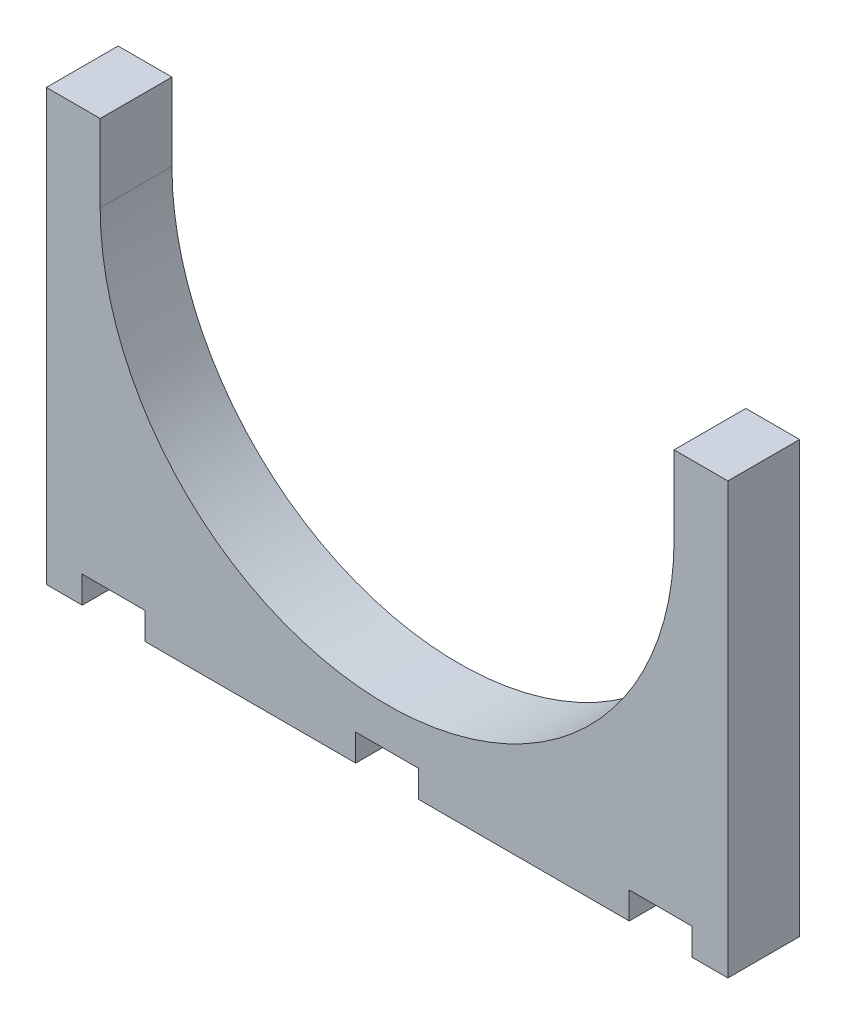
ISO-10303-21;
HEADER;
FILE_DESCRIPTION(('STEP AP214'),'2;1');
FILE_NAME('part.step','',(''),(''),'','','');
FILE_SCHEMA(('AUTOMOTIVE_DESIGN { 1 0 10303 214 1 1 1 1 }'));
ENDSEC;
DATA;
#1=APPLICATION_CONTEXT('core data for automotive mechanical design processes');
#2=APPLICATION_PROTOCOL_DEFINITION('international standard','automotive_design',2000,#1);
#3=PRODUCT_CONTEXT('',#1,'mechanical');
#4=PRODUCT('Part','Part','',(#3));
#5=PRODUCT_RELATED_PRODUCT_CATEGORY('part','',(#4));
#6=PRODUCT_DEFINITION_FORMATION('','',#4);
#7=PRODUCT_DEFINITION_CONTEXT('part definition',#1,'design');
#8=PRODUCT_DEFINITION('design','',#6,#7);
#9=PRODUCT_DEFINITION_SHAPE('','',#8);
#10=(LENGTH_UNIT() NAMED_UNIT(*) SI_UNIT(.MILLI.,.METRE.));
#11=(NAMED_UNIT(*) PLANE_ANGLE_UNIT() SI_UNIT($,.RADIAN.));
#12=(NAMED_UNIT(*) SI_UNIT($,.STERADIAN.) SOLID_ANGLE_UNIT());
#13=UNCERTAINTY_MEASURE_WITH_UNIT(LENGTH_MEASURE(1.E-05),#10,'distance_accuracy_value','');
#14=(GEOMETRIC_REPRESENTATION_CONTEXT(3) GLOBAL_UNCERTAINTY_ASSIGNED_CONTEXT((#13)) GLOBAL_UNIT_ASSIGNED_CONTEXT((#10,
#11,#12)) REPRESENTATION_CONTEXT('',''));
#15=CARTESIAN_POINT('',(0.,0.,0.));
#16=DIRECTION('',(0.,0.,1.));
#17=DIRECTION('',(1.,0.,0.));
#18=AXIS2_PLACEMENT_3D('',#15,#16,#17);
#19=CARTESIAN_POINT('',(0.,0.,101.6));
#20=DIRECTION('',(1.,0.,0.));
#21=DIRECTION('',(0.,0.,-1.));
#22=AXIS2_PLACEMENT_3D('',#19,#20,#21);
#23=PLANE('',#22);
#24=DIRECTION('',(0.,-1.,0.));
#25=VECTOR('',#24,1.);
#26=CARTESIAN_POINT('',(0.,0.,0.));
#27=LINE('',#26,#25);
#28=CARTESIAN_POINT('',(0.,609.6,0.));
#29=VERTEX_POINT('',#28);
#30=CARTESIAN_POINT('',(0.,0.,0.));
#31=VERTEX_POINT('',#30);
#32=EDGE_CURVE('E203',#29,#31,#27,.T.);
#33=ORIENTED_EDGE('',*,*,#32,.T.);
#34=DIRECTION('',(0.,0.,-1.));
#35=VECTOR('',#34,1.);
#36=CARTESIAN_POINT('',(0.,0.,101.6));
#37=LINE('',#36,#35);
#38=CARTESIAN_POINT('',(0.,0.,101.6));
#39=VERTEX_POINT('',#38);
#40=EDGE_CURVE('E11',#39,#31,#37,.T.);
#41=ORIENTED_EDGE('',*,*,#40,.F.);
#42=DIRECTION('',(0.,-1.,0.));
#43=VECTOR('',#42,1.);
#44=CARTESIAN_POINT('',(0.,0.,101.6));
#45=LINE('',#44,#43);
#46=CARTESIAN_POINT('',(0.,609.6,101.6));
#47=VERTEX_POINT('',#46);
#48=EDGE_CURVE('E241',#47,#39,#45,.T.);
#49=ORIENTED_EDGE('',*,*,#48,.F.);
#50=DIRECTION('',(0.,0.,-1.));
#51=VECTOR('',#50,1.);
#52=CARTESIAN_POINT('',(0.,609.6,101.6));
#53=LINE('',#52,#51);
#54=EDGE_CURVE('E199',#47,#29,#53,.T.);
#55=ORIENTED_EDGE('',*,*,#54,.T.);
#56=EDGE_LOOP('',(#33,#41,#49,#55));
#57=FACE_BOUND('',#56,.T.);
#58=ADVANCED_FACE('F35',(#57),#23,.F.);
#59=CARTESIAN_POINT('',(0.,0.,101.6));
#60=DIRECTION('',(0.,1.,0.));
#61=DIRECTION('',(0.,0.,1.));
#62=AXIS2_PLACEMENT_3D('',#59,#60,#61);
#63=PLANE('',#62);
#64=DIRECTION('',(1.,0.,0.));
#65=VECTOR('',#64,1.);
#66=CARTESIAN_POINT('',(0.,0.,0.));
#67=LINE('',#66,#65);
#68=CARTESIAN_POINT('',(50.8,0.,0.));
#69=VERTEX_POINT('',#68);
#70=EDGE_CURVE('E206',#31,#69,#67,.T.);
#71=ORIENTED_EDGE('',*,*,#70,.T.);
#72=DIRECTION('',(0.,0.,-1.));
#73=VECTOR('',#72,1.);
#74=CARTESIAN_POINT('',(50.8,0.,101.6));
#75=LINE('',#74,#73);
#76=CARTESIAN_POINT('',(50.8,0.,101.6));
#77=VERTEX_POINT('',#76);
#78=EDGE_CURVE('E43',#77,#69,#75,.T.);
#79=ORIENTED_EDGE('',*,*,#78,.F.);
#80=DIRECTION('',(1.,0.,0.));
#81=VECTOR('',#80,1.);
#82=CARTESIAN_POINT('',(0.,0.,101.6));
#83=LINE('',#82,#81);
#84=EDGE_CURVE('E130',#39,#77,#83,.T.);
#85=ORIENTED_EDGE('',*,*,#84,.F.);
#86=ORIENTED_EDGE('',*,*,#40,.T.);
#87=EDGE_LOOP('',(#71,#79,#85,#86));
#88=FACE_BOUND('',#87,.T.);
#89=ADVANCED_FACE('F359',(#88),#63,.F.);
#90=CARTESIAN_POINT('',(50.8,0.,101.6));
#91=DIRECTION('',(-1.,0.,0.));
#92=DIRECTION('',(0.,0.,1.));
#93=AXIS2_PLACEMENT_3D('',#90,#91,#92);
#94=PLANE('',#93);
#95=DIRECTION('',(0.,1.,0.));
#96=VECTOR('',#95,1.);
#97=CARTESIAN_POINT('',(50.8,0.,0.));
#98=LINE('',#97,#96);
#99=CARTESIAN_POINT('',(50.8,38.1,0.));
#100=VERTEX_POINT('',#99);
#101=EDGE_CURVE('E208',#69,#100,#98,.T.);
#102=ORIENTED_EDGE('',*,*,#101,.T.);
#103=DIRECTION('',(0.,0.,-1.));
#104=VECTOR('',#103,1.);
#105=CARTESIAN_POINT('',(50.8,38.1,101.6));
#106=LINE('',#105,#104);
#107=CARTESIAN_POINT('',(50.8,38.1,101.6));
#108=VERTEX_POINT('',#107);
#109=EDGE_CURVE('E284',#108,#100,#106,.T.);
#110=ORIENTED_EDGE('',*,*,#109,.F.);
#111=DIRECTION('',(0.,1.,0.));
#112=VECTOR('',#111,1.);
#113=CARTESIAN_POINT('',(50.8,0.,101.6));
#114=LINE('',#113,#112);
#115=EDGE_CURVE('E292',#77,#108,#114,.T.);
#116=ORIENTED_EDGE('',*,*,#115,.F.);
#117=ORIENTED_EDGE('',*,*,#78,.T.);
#118=EDGE_LOOP('',(#102,#110,#116,#117));
#119=FACE_BOUND('',#118,.T.);
#120=ADVANCED_FACE('F290',(#119),#94,.F.);
#121=CARTESIAN_POINT('',(50.8,38.1,101.6));
#122=DIRECTION('',(0.,1.,0.));
#123=DIRECTION('',(0.,0.,1.));
#124=AXIS2_PLACEMENT_3D('',#121,#122,#123);
#125=PLANE('',#124);
#126=DIRECTION('',(1.,0.,0.));
#127=VECTOR('',#126,1.);
#128=CARTESIAN_POINT('',(50.8,38.1,0.));
#129=LINE('',#128,#127);
#130=CARTESIAN_POINT('',(139.7,38.1,0.));
#131=VERTEX_POINT('',#130);
#132=EDGE_CURVE('E210',#100,#131,#129,.T.);
#133=ORIENTED_EDGE('',*,*,#132,.T.);
#134=DIRECTION('',(0.,0.,-1.));
#135=VECTOR('',#134,1.);
#136=CARTESIAN_POINT('',(139.7,38.1,101.6));
#137=LINE('',#136,#135);
#138=CARTESIAN_POINT('',(139.7,38.1,101.6));
#139=VERTEX_POINT('',#138);
#140=EDGE_CURVE('E281',#139,#131,#137,.T.);
#141=ORIENTED_EDGE('',*,*,#140,.F.);
#142=DIRECTION('',(1.,0.,0.));
#143=VECTOR('',#142,1.);
#144=CARTESIAN_POINT('',(50.8,38.1,101.6));
#145=LINE('',#144,#143);
#146=EDGE_CURVE('E310',#108,#139,#145,.T.);
#147=ORIENTED_EDGE('',*,*,#146,.F.);
#148=ORIENTED_EDGE('',*,*,#109,.T.);
#149=EDGE_LOOP('',(#133,#141,#147,#148));
#150=FACE_BOUND('',#149,.T.);
#151=ADVANCED_FACE('F301',(#150),#125,.F.);
#152=CARTESIAN_POINT('',(139.7,38.1,101.6));
#153=DIRECTION('',(1.,0.,0.));
#154=DIRECTION('',(0.,0.,-1.));
#155=AXIS2_PLACEMENT_3D('',#152,#153,#154);
#156=PLANE('',#155);
#157=DIRECTION('',(0.,-1.,0.));
#158=VECTOR('',#157,1.);
#159=CARTESIAN_POINT('',(139.7,38.1,0.));
#160=LINE('',#159,#158);
#161=CARTESIAN_POINT('',(139.7,0.,0.));
#162=VERTEX_POINT('',#161);
#163=EDGE_CURVE('E212',#131,#162,#160,.T.);
#164=ORIENTED_EDGE('',*,*,#163,.T.);
#165=DIRECTION('',(0.,0.,-1.));
#166=VECTOR('',#165,1.);
#167=CARTESIAN_POINT('',(139.7,0.,101.6));
#168=LINE('',#167,#166);
#169=CARTESIAN_POINT('',(139.7,0.,101.6));
#170=VERTEX_POINT('',#169);
#171=EDGE_CURVE('E278',#170,#162,#168,.T.);
#172=ORIENTED_EDGE('',*,*,#171,.F.);
#173=DIRECTION('',(0.,-1.,0.));
#174=VECTOR('',#173,1.);
#175=CARTESIAN_POINT('',(139.7,38.1,101.6));
#176=LINE('',#175,#174);
#177=EDGE_CURVE('E307',#139,#170,#176,.T.);
#178=ORIENTED_EDGE('',*,*,#177,.F.);
#179=ORIENTED_EDGE('',*,*,#140,.T.);
#180=EDGE_LOOP('',(#164,#172,#178,#179));
#181=FACE_BOUND('',#180,.T.);
#182=ADVANCED_FACE('F305',(#181),#156,.F.);
#183=CARTESIAN_POINT('',(139.7,0.,101.6));
#184=DIRECTION('',(0.,1.,0.));
#185=DIRECTION('',(0.,0.,1.));
#186=AXIS2_PLACEMENT_3D('',#183,#184,#185);
#187=PLANE('',#186);
#188=DIRECTION('',(1.,0.,0.));
#189=VECTOR('',#188,1.);
#190=CARTESIAN_POINT('',(139.7,0.,0.));
#191=LINE('',#190,#189);
#192=CARTESIAN_POINT('',(438.1,0.,0.));
#193=VERTEX_POINT('',#192);
#194=EDGE_CURVE('E214',#162,#193,#191,.T.);
#195=ORIENTED_EDGE('',*,*,#194,.T.);
#196=DIRECTION('',(0.,0.,-1.));
#197=VECTOR('',#196,1.);
#198=CARTESIAN_POINT('',(438.1,0.,101.6));
#199=LINE('',#198,#197);
#200=CARTESIAN_POINT('',(438.1,0.,101.6));
#201=VERTEX_POINT('',#200);
#202=EDGE_CURVE('E275',#201,#193,#199,.T.);
#203=ORIENTED_EDGE('',*,*,#202,.F.);
#204=DIRECTION('',(1.,0.,0.));
#205=VECTOR('',#204,1.);
#206=CARTESIAN_POINT('',(139.7,0.,101.6));
#207=LINE('',#206,#205);
#208=EDGE_CURVE('E309',#170,#201,#207,.T.);
#209=ORIENTED_EDGE('',*,*,#208,.F.);
#210=ORIENTED_EDGE('',*,*,#171,.T.);
#211=EDGE_LOOP('',(#195,#203,#209,#210));
#212=FACE_BOUND('',#211,.T.);
#213=ADVANCED_FACE('F372',(#212),#187,.F.);
#214=CARTESIAN_POINT('',(438.1,0.,101.6));
#215=DIRECTION('',(-1.,0.,0.));
#216=DIRECTION('',(0.,0.,1.));
#217=AXIS2_PLACEMENT_3D('',#214,#215,#216);
#218=PLANE('',#217);
#219=DIRECTION('',(0.,1.,0.));
#220=VECTOR('',#219,1.);
#221=CARTESIAN_POINT('',(438.1,0.,0.));
#222=LINE('',#221,#220);
#223=CARTESIAN_POINT('',(438.1,38.1,0.));
#224=VERTEX_POINT('',#223);
#225=EDGE_CURVE('E216',#193,#224,#222,.T.);
#226=ORIENTED_EDGE('',*,*,#225,.T.);
#227=DIRECTION('',(0.,0.,-1.));
#228=VECTOR('',#227,1.);
#229=CARTESIAN_POINT('',(438.1,38.1,101.6));
#230=LINE('',#229,#228);
#231=CARTESIAN_POINT('',(438.1,38.1,101.6));
#232=VERTEX_POINT('',#231);
#233=EDGE_CURVE('E272',#232,#224,#230,.T.);
#234=ORIENTED_EDGE('',*,*,#233,.F.);
#235=DIRECTION('',(0.,1.,0.));
#236=VECTOR('',#235,1.);
#237=CARTESIAN_POINT('',(438.1,0.,101.6));
#238=LINE('',#237,#236);
#239=EDGE_CURVE('E312',#201,#232,#238,.T.);
#240=ORIENTED_EDGE('',*,*,#239,.F.);
#241=ORIENTED_EDGE('',*,*,#202,.T.);
#242=EDGE_LOOP('',(#226,#234,#240,#241));
#243=FACE_BOUND('',#242,.T.);
#244=ADVANCED_FACE('F375',(#243),#218,.F.);
#245=CARTESIAN_POINT('',(438.1,38.1,101.6));
#246=DIRECTION('',(0.,1.,0.));
#247=DIRECTION('',(0.,0.,1.));
#248=AXIS2_PLACEMENT_3D('',#245,#246,#247);
#249=PLANE('',#248);
#250=DIRECTION('',(1.,0.,0.));
#251=VECTOR('',#250,1.);
#252=CARTESIAN_POINT('',(438.1,38.1,0.));
#253=LINE('',#252,#251);
#254=CARTESIAN_POINT('',(527.,38.1,0.));
#255=VERTEX_POINT('',#254);
#256=EDGE_CURVE('E218',#224,#255,#253,.T.);
#257=ORIENTED_EDGE('',*,*,#256,.T.);
#258=DIRECTION('',(0.,0.,-1.));
#259=VECTOR('',#258,1.);
#260=CARTESIAN_POINT('',(527.,38.1,101.6));
#261=LINE('',#260,#259);
#262=CARTESIAN_POINT('',(527.,38.1,101.6));
#263=VERTEX_POINT('',#262);
#264=EDGE_CURVE('E269',#263,#255,#261,.T.);
#265=ORIENTED_EDGE('',*,*,#264,.F.);
#266=DIRECTION('',(1.,0.,0.));
#267=VECTOR('',#266,1.);
#268=CARTESIAN_POINT('',(438.1,38.1,101.6));
#269=LINE('',#268,#267);
#270=EDGE_CURVE('E318',#232,#263,#269,.T.);
#271=ORIENTED_EDGE('',*,*,#270,.F.);
#272=ORIENTED_EDGE('',*,*,#233,.T.);
#273=EDGE_LOOP('',(#257,#265,#271,#272));
#274=FACE_BOUND('',#273,.T.);
#275=ADVANCED_FACE('F379',(#274),#249,.F.);
#276=CARTESIAN_POINT('',(527.,38.1,101.6));
#277=DIRECTION('',(1.,0.,0.));
#278=DIRECTION('',(0.,0.,-1.));
#279=AXIS2_PLACEMENT_3D('',#276,#277,#278);
#280=PLANE('',#279);
#281=DIRECTION('',(0.,-1.,0.));
#282=VECTOR('',#281,1.);
#283=CARTESIAN_POINT('',(527.,38.1,0.));
#284=LINE('',#283,#282);
#285=CARTESIAN_POINT('',(527.,0.,0.));
#286=VERTEX_POINT('',#285);
#287=EDGE_CURVE('E220',#255,#286,#284,.T.);
#288=ORIENTED_EDGE('',*,*,#287,.T.);
#289=DIRECTION('',(0.,0.,-1.));
#290=VECTOR('',#289,1.);
#291=CARTESIAN_POINT('',(527.,0.,101.6));
#292=LINE('',#291,#290);
#293=CARTESIAN_POINT('',(527.,0.,101.6));
#294=VERTEX_POINT('',#293);
#295=EDGE_CURVE('E266',#294,#286,#292,.T.);
#296=ORIENTED_EDGE('',*,*,#295,.F.);
#297=DIRECTION('',(0.,-1.,0.));
#298=VECTOR('',#297,1.);
#299=CARTESIAN_POINT('',(527.,38.1,101.6));
#300=LINE('',#299,#298);
#301=EDGE_CURVE('E320',#263,#294,#300,.T.);
#302=ORIENTED_EDGE('',*,*,#301,.F.);
#303=ORIENTED_EDGE('',*,*,#264,.T.);
#304=EDGE_LOOP('',(#288,#296,#302,#303));
#305=FACE_BOUND('',#304,.T.);
#306=ADVANCED_FACE('F383',(#305),#280,.F.);
#307=CARTESIAN_POINT('',(527.,0.,101.6));
#308=DIRECTION('',(0.,1.,0.));
#309=DIRECTION('',(0.,0.,1.));
#310=AXIS2_PLACEMENT_3D('',#307,#308,#309);
#311=PLANE('',#310);
#312=DIRECTION('',(1.,0.,0.));
#313=VECTOR('',#312,1.);
#314=CARTESIAN_POINT('',(527.,0.,0.));
#315=LINE('',#314,#313);
#316=CARTESIAN_POINT('',(825.4,0.,0.));
#317=VERTEX_POINT('',#316);
#318=EDGE_CURVE('E222',#286,#317,#315,.T.);
#319=ORIENTED_EDGE('',*,*,#318,.T.);
#320=DIRECTION('',(0.,0.,-1.));
#321=VECTOR('',#320,1.);
#322=CARTESIAN_POINT('',(825.4,0.,101.6));
#323=LINE('',#322,#321);
#324=CARTESIAN_POINT('',(825.4,0.,101.6));
#325=VERTEX_POINT('',#324);
#326=EDGE_CURVE('E263',#325,#317,#323,.T.);
#327=ORIENTED_EDGE('',*,*,#326,.F.);
#328=DIRECTION('',(1.,0.,0.));
#329=VECTOR('',#328,1.);
#330=CARTESIAN_POINT('',(527.,0.,101.6));
#331=LINE('',#330,#329);
#332=EDGE_CURVE('E322',#294,#325,#331,.T.);
#333=ORIENTED_EDGE('',*,*,#332,.F.);
#334=ORIENTED_EDGE('',*,*,#295,.T.);
#335=EDGE_LOOP('',(#319,#327,#333,#334));
#336=FACE_BOUND('',#335,.T.);
#337=ADVANCED_FACE('F387',(#336),#311,.F.);
#338=CARTESIAN_POINT('',(825.4,0.,101.6));
#339=DIRECTION('',(-1.,0.,0.));
#340=DIRECTION('',(0.,0.,1.));
#341=AXIS2_PLACEMENT_3D('',#338,#339,#340);
#342=PLANE('',#341);
#343=DIRECTION('',(0.,1.,0.));
#344=VECTOR('',#343,1.);
#345=CARTESIAN_POINT('',(825.4,0.,0.));
#346=LINE('',#345,#344);
#347=CARTESIAN_POINT('',(825.4,38.1,0.));
#348=VERTEX_POINT('',#347);
#349=EDGE_CURVE('E224',#317,#348,#346,.T.);
#350=ORIENTED_EDGE('',*,*,#349,.T.);
#351=DIRECTION('',(0.,0.,-1.));
#352=VECTOR('',#351,1.);
#353=CARTESIAN_POINT('',(825.4,38.1,101.6));
#354=LINE('',#353,#352);
#355=CARTESIAN_POINT('',(825.4,38.1,101.6));
#356=VERTEX_POINT('',#355);
#357=EDGE_CURVE('E260',#356,#348,#354,.T.);
#358=ORIENTED_EDGE('',*,*,#357,.F.);
#359=DIRECTION('',(0.,1.,0.));
#360=VECTOR('',#359,1.);
#361=CARTESIAN_POINT('',(825.4,0.,101.6));
#362=LINE('',#361,#360);
#363=EDGE_CURVE('E324',#325,#356,#362,.T.);
#364=ORIENTED_EDGE('',*,*,#363,.F.);
#365=ORIENTED_EDGE('',*,*,#326,.T.);
#366=EDGE_LOOP('',(#350,#358,#364,#365));
#367=FACE_BOUND('',#366,.T.);
#368=ADVANCED_FACE('F391',(#367),#342,.F.);
#369=CARTESIAN_POINT('',(825.4,38.1,101.6));
#370=DIRECTION('',(0.,1.,0.));
#371=DIRECTION('',(0.,0.,1.));
#372=AXIS2_PLACEMENT_3D('',#369,#370,#371);
#373=PLANE('',#372);
#374=DIRECTION('',(1.,0.,0.));
#375=VECTOR('',#374,1.);
#376=CARTESIAN_POINT('',(825.4,38.1,0.));
#377=LINE('',#376,#375);
#378=CARTESIAN_POINT('',(914.3,38.1,0.));
#379=VERTEX_POINT('',#378);
#380=EDGE_CURVE('E226',#348,#379,#377,.T.);
#381=ORIENTED_EDGE('',*,*,#380,.T.);
#382=DIRECTION('',(0.,0.,-1.));
#383=VECTOR('',#382,1.);
#384=CARTESIAN_POINT('',(914.3,38.1,101.6));
#385=LINE('',#384,#383);
#386=CARTESIAN_POINT('',(914.3,38.1,101.6));
#387=VERTEX_POINT('',#386);
#388=EDGE_CURVE('E257',#387,#379,#385,.T.);
#389=ORIENTED_EDGE('',*,*,#388,.F.);
#390=DIRECTION('',(1.,0.,0.));
#391=VECTOR('',#390,1.);
#392=CARTESIAN_POINT('',(825.4,38.1,101.6));
#393=LINE('',#392,#391);
#394=EDGE_CURVE('E326',#356,#387,#393,.T.);
#395=ORIENTED_EDGE('',*,*,#394,.F.);
#396=ORIENTED_EDGE('',*,*,#357,.T.);
#397=EDGE_LOOP('',(#381,#389,#395,#396));
#398=FACE_BOUND('',#397,.T.);
#399=ADVANCED_FACE('F395',(#398),#373,.F.);
#400=CARTESIAN_POINT('',(914.3,38.1,101.6));
#401=DIRECTION('',(1.,0.,0.));
#402=DIRECTION('',(0.,1.,0.));
#403=AXIS2_PLACEMENT_3D('',#400,#401,#402);
#404=PLANE('',#403);
#405=DIRECTION('',(0.,-1.,0.));
#406=VECTOR('',#405,1.);
#407=CARTESIAN_POINT('',(914.3,38.1,0.));
#408=LINE('',#407,#406);
#409=CARTESIAN_POINT('',(914.3,0.,0.));
#410=VERTEX_POINT('',#409);
#411=EDGE_CURVE('E228',#379,#410,#408,.T.);
#412=ORIENTED_EDGE('',*,*,#411,.T.);
#413=DIRECTION('',(0.,0.,-1.));
#414=VECTOR('',#413,1.);
#415=CARTESIAN_POINT('',(914.3,0.,101.6));
#416=LINE('',#415,#414);
#417=CARTESIAN_POINT('',(914.3,0.,101.6));
#418=VERTEX_POINT('',#417);
#419=EDGE_CURVE('E254',#418,#410,#416,.T.);
#420=ORIENTED_EDGE('',*,*,#419,.F.);
#421=DIRECTION('',(0.,-1.,0.));
#422=VECTOR('',#421,1.);
#423=CARTESIAN_POINT('',(914.3,38.1,101.6));
#424=LINE('',#423,#422);
#425=EDGE_CURVE('E328',#387,#418,#424,.T.);
#426=ORIENTED_EDGE('',*,*,#425,.F.);
#427=ORIENTED_EDGE('',*,*,#388,.T.);
#428=EDGE_LOOP('',(#412,#420,#426,#427));
#429=FACE_BOUND('',#428,.T.);
#430=ADVANCED_FACE('F399',(#429),#404,.F.);
#431=CARTESIAN_POINT('',(914.3,0.,101.6));
#432=DIRECTION('',(0.,1.,0.));
#433=DIRECTION('',(-1.,0.,0.));
#434=AXIS2_PLACEMENT_3D('',#431,#432,#433);
#435=PLANE('',#434);
#436=DIRECTION('',(1.,0.,0.));
#437=VECTOR('',#436,1.);
#438=CARTESIAN_POINT('',(914.3,0.,0.));
#439=LINE('',#438,#437);
#440=CARTESIAN_POINT('',(965.1,0.,0.));
#441=VERTEX_POINT('',#440);
#442=EDGE_CURVE('E230',#410,#441,#439,.T.);
#443=ORIENTED_EDGE('',*,*,#442,.T.);
#444=DIRECTION('',(0.,0.,-1.));
#445=VECTOR('',#444,1.);
#446=CARTESIAN_POINT('',(965.1,0.,101.6));
#447=LINE('',#446,#445);
#448=CARTESIAN_POINT('',(965.1,0.,101.6));
#449=VERTEX_POINT('',#448);
#450=EDGE_CURVE('E251',#449,#441,#447,.T.);
#451=ORIENTED_EDGE('',*,*,#450,.F.);
#452=DIRECTION('',(1.,0.,0.));
#453=VECTOR('',#452,1.);
#454=CARTESIAN_POINT('',(914.3,0.,101.6));
#455=LINE('',#454,#453);
#456=EDGE_CURVE('E330',#418,#449,#455,.T.);
#457=ORIENTED_EDGE('',*,*,#456,.F.);
#458=ORIENTED_EDGE('',*,*,#419,.T.);
#459=EDGE_LOOP('',(#443,#451,#457,#458));
#460=FACE_BOUND('',#459,.T.);
#461=ADVANCED_FACE('F403',(#460),#435,.F.);
#462=CARTESIAN_POINT('',(965.1,0.,101.6));
#463=DIRECTION('',(-1.,0.,0.));
#464=DIRECTION('',(0.,0.,1.));
#465=AXIS2_PLACEMENT_3D('',#462,#463,#464);
#466=PLANE('',#465);
#467=DIRECTION('',(0.,1.,0.));
#468=VECTOR('',#467,1.);
#469=CARTESIAN_POINT('',(965.1,0.,0.));
#470=LINE('',#469,#468);
#471=CARTESIAN_POINT('',(965.1,609.6,0.));
#472=VERTEX_POINT('',#471);
#473=EDGE_CURVE('E232',#441,#472,#470,.T.);
#474=ORIENTED_EDGE('',*,*,#473,.T.);
#475=DIRECTION('',(0.,0.,-1.));
#476=VECTOR('',#475,1.);
#477=CARTESIAN_POINT('',(965.1,609.6,101.6));
#478=LINE('',#477,#476);
#479=CARTESIAN_POINT('',(965.1,609.6,101.6));
#480=VERTEX_POINT('',#479);
#481=EDGE_CURVE('E248',#480,#472,#478,.T.);
#482=ORIENTED_EDGE('',*,*,#481,.F.);
#483=DIRECTION('',(0.,1.,0.));
#484=VECTOR('',#483,1.);
#485=CARTESIAN_POINT('',(965.1,0.,101.6));
#486=LINE('',#485,#484);
#487=EDGE_CURVE('E332',#449,#480,#486,.T.);
#488=ORIENTED_EDGE('',*,*,#487,.F.);
#489=ORIENTED_EDGE('',*,*,#450,.T.);
#490=EDGE_LOOP('',(#474,#482,#488,#489));
#491=FACE_BOUND('',#490,.T.);
#492=ADVANCED_FACE('F407',(#491),#466,.F.);
#493=CARTESIAN_POINT('',(888.9,609.6,101.6));
#494=DIRECTION('',(0.,-1.,0.));
#495=DIRECTION('',(0.,0.,-1.));
#496=AXIS2_PLACEMENT_3D('',#493,#494,#495);
#497=PLANE('',#496);
#498=DIRECTION('',(-1.,0.,0.));
#499=VECTOR('',#498,1.);
#500=CARTESIAN_POINT('',(888.9,609.6,0.));
#501=LINE('',#500,#499);
#502=CARTESIAN_POINT('',(888.9,609.6,0.));
#503=VERTEX_POINT('',#502);
#504=EDGE_CURVE('E234',#472,#503,#501,.T.);
#505=ORIENTED_EDGE('',*,*,#504,.T.);
#506=DIRECTION('',(0.,0.,-1.));
#507=VECTOR('',#506,1.);
#508=CARTESIAN_POINT('',(888.9,609.6,101.6));
#509=LINE('',#508,#507);
#510=CARTESIAN_POINT('',(888.9,609.6,101.6));
#511=VERTEX_POINT('',#510);
#512=EDGE_CURVE('E245',#511,#503,#509,.T.);
#513=ORIENTED_EDGE('',*,*,#512,.F.);
#514=DIRECTION('',(-1.,0.,0.));
#515=VECTOR('',#514,1.);
#516=CARTESIAN_POINT('',(888.9,609.6,101.6));
#517=LINE('',#516,#515);
#518=EDGE_CURVE('E334',#480,#511,#517,.T.);
#519=ORIENTED_EDGE('',*,*,#518,.F.);
#520=ORIENTED_EDGE('',*,*,#481,.T.);
#521=EDGE_LOOP('',(#505,#513,#519,#520));
#522=FACE_BOUND('',#521,.T.);
#523=ADVANCED_FACE('F340',(#522),#497,.F.);
#524=CARTESIAN_POINT('',(888.9,500.,101.6));
#525=DIRECTION('',(1.,0.,0.));
#526=DIRECTION('',(0.,1.,0.));
#527=AXIS2_PLACEMENT_3D('',#524,#525,#526);
#528=PLANE('',#527);
#529=DIRECTION('',(0.,-1.,0.));
#530=VECTOR('',#529,1.);
#531=CARTESIAN_POINT('',(888.9,500.,0.));
#532=LINE('',#531,#530);
#533=CARTESIAN_POINT('',(888.9,500.,0.));
#534=VERTEX_POINT('',#533);
#535=EDGE_CURVE('E236',#503,#534,#532,.T.);
#536=ORIENTED_EDGE('',*,*,#535,.T.);
#537=DIRECTION('',(0.,0.,-1.));
#538=VECTOR('',#537,1.);
#539=CARTESIAN_POINT('',(888.9,500.,101.6));
#540=LINE('',#539,#538);
#541=CARTESIAN_POINT('',(888.9,500.,101.6));
#542=VERTEX_POINT('',#541);
#543=EDGE_CURVE('E194',#542,#534,#540,.T.);
#544=ORIENTED_EDGE('',*,*,#543,.F.);
#545=DIRECTION('',(0.,-1.,0.));
#546=VECTOR('',#545,1.);
#547=CARTESIAN_POINT('',(888.9,500.,101.6));
#548=LINE('',#547,#546);
#549=EDGE_CURVE('E185',#511,#542,#548,.T.);
#550=ORIENTED_EDGE('',*,*,#549,.F.);
#551=ORIENTED_EDGE('',*,*,#512,.T.);
#552=EDGE_LOOP('',(#536,#544,#550,#551));
#553=FACE_BOUND('',#552,.T.);
#554=ADVANCED_FACE('F344',(#553),#528,.F.);
#555=CARTESIAN_POINT('',(482.55,500.,101.6));
#556=DIRECTION('',(0.,0.,-1.));
#557=DIRECTION('',(-1.,0.,0.));
#558=AXIS2_PLACEMENT_3D('',#555,#556,#557);
#559=CYLINDRICAL_SURFACE('',#558,406.35);
#560=CARTESIAN_POINT('',(482.55,500.,0.));
#561=DIRECTION('',(0.,0.,-1.));
#562=DIRECTION('',(1.,0.,0.));
#563=AXIS2_PLACEMENT_3D('',#560,#561,#562);
#564=CIRCLE('',#563,406.35);
#565=CARTESIAN_POINT('',(76.1999999999998,500.,0.));
#566=VERTEX_POINT('',#565);
#567=EDGE_CURVE('E193',#534,#566,#564,.T.);
#568=ORIENTED_EDGE('',*,*,#567,.T.);
#569=DIRECTION('',(0.,0.,-1.));
#570=VECTOR('',#569,1.);
#571=CARTESIAN_POINT('',(76.1999999999998,500.,101.6));
#572=LINE('',#571,#570);
#573=CARTESIAN_POINT('',(76.1999999999998,500.,101.6));
#574=VERTEX_POINT('',#573);
#575=EDGE_CURVE('E190',#574,#566,#572,.T.);
#576=ORIENTED_EDGE('',*,*,#575,.F.);
#577=CARTESIAN_POINT('',(482.55,500.,101.6));
#578=DIRECTION('',(0.,0.,-1.));
#579=DIRECTION('',(1.,0.,0.));
#580=AXIS2_PLACEMENT_3D('',#577,#578,#579);
#581=CIRCLE('',#580,406.35);
#582=EDGE_CURVE('E179',#542,#574,#581,.T.);
#583=ORIENTED_EDGE('',*,*,#582,.F.);
#584=ORIENTED_EDGE('',*,*,#543,.T.);
#585=EDGE_LOOP('',(#568,#576,#583,#584));
#586=FACE_BOUND('',#585,.T.);
#587=ADVANCED_FACE('F191',(#586),#559,.F.);
#588=CARTESIAN_POINT('',(76.1999999999998,500.,101.6));
#589=DIRECTION('',(-1.,0.,0.));
#590=DIRECTION('',(0.,-1.,0.));
#591=AXIS2_PLACEMENT_3D('',#588,#589,#590);
#592=PLANE('',#591);
#593=DIRECTION('',(0.,1.,0.));
#594=VECTOR('',#593,1.);
#595=CARTESIAN_POINT('',(76.1999999999998,500.,0.));
#596=LINE('',#595,#594);
#597=CARTESIAN_POINT('',(76.1999999999997,609.6,0.));
#598=VERTEX_POINT('',#597);
#599=EDGE_CURVE('E116',#566,#598,#596,.T.);
#600=ORIENTED_EDGE('',*,*,#599,.T.);
#601=DIRECTION('',(0.,0.,-1.));
#602=VECTOR('',#601,1.);
#603=CARTESIAN_POINT('',(76.1999999999997,609.6,101.6));
#604=LINE('',#603,#602);
#605=CARTESIAN_POINT('',(76.1999999999997,609.6,101.6));
#606=VERTEX_POINT('',#605);
#607=EDGE_CURVE('E195',#606,#598,#604,.T.);
#608=ORIENTED_EDGE('',*,*,#607,.F.);
#609=DIRECTION('',(0.,1.,0.));
#610=VECTOR('',#609,1.);
#611=CARTESIAN_POINT('',(76.1999999999998,500.,101.6));
#612=LINE('',#611,#610);
#613=EDGE_CURVE('E183',#574,#606,#612,.T.);
#614=ORIENTED_EDGE('',*,*,#613,.F.);
#615=ORIENTED_EDGE('',*,*,#575,.T.);
#616=EDGE_LOOP('',(#600,#608,#614,#615));
#617=FACE_BOUND('',#616,.T.);
#618=ADVANCED_FACE('F197',(#617),#592,.F.);
#619=CARTESIAN_POINT('',(0.,609.6,101.6));
#620=DIRECTION('',(0.,-1.,0.));
#621=DIRECTION('',(0.,0.,-1.));
#622=AXIS2_PLACEMENT_3D('',#619,#620,#621);
#623=PLANE('',#622);
#624=DIRECTION('',(-1.,0.,0.));
#625=VECTOR('',#624,1.);
#626=CARTESIAN_POINT('',(0.,609.6,0.));
#627=LINE('',#626,#625);
#628=EDGE_CURVE('E122',#598,#29,#627,.T.);
#629=ORIENTED_EDGE('',*,*,#628,.T.);
#630=ORIENTED_EDGE('',*,*,#54,.F.);
#631=DIRECTION('',(-1.,0.,0.));
#632=VECTOR('',#631,1.);
#633=CARTESIAN_POINT('',(0.,609.6,101.6));
#634=LINE('',#633,#632);
#635=EDGE_CURVE('E51',#606,#47,#634,.T.);
#636=ORIENTED_EDGE('',*,*,#635,.F.);
#637=ORIENTED_EDGE('',*,*,#607,.T.);
#638=EDGE_LOOP('',(#629,#630,#636,#637));
#639=FACE_BOUND('',#638,.T.);
#640=ADVANCED_FACE('F348',(#639),#623,.F.);
#641=CARTESIAN_POINT('',(482.55,500.,101.6));
#642=DIRECTION('',(0.,0.,1.));
#643=DIRECTION('',(1.,0.,0.));
#644=AXIS2_PLACEMENT_3D('',#641,#642,#643);
#645=PLANE('',#644);
#646=ORIENTED_EDGE('',*,*,#48,.T.);
#647=ORIENTED_EDGE('',*,*,#84,.T.);
#648=ORIENTED_EDGE('',*,*,#115,.T.);
#649=ORIENTED_EDGE('',*,*,#146,.T.);
#650=ORIENTED_EDGE('',*,*,#177,.T.);
#651=ORIENTED_EDGE('',*,*,#208,.T.);
#652=ORIENTED_EDGE('',*,*,#239,.T.);
#653=ORIENTED_EDGE('',*,*,#270,.T.);
#654=ORIENTED_EDGE('',*,*,#301,.T.);
#655=ORIENTED_EDGE('',*,*,#332,.T.);
#656=ORIENTED_EDGE('',*,*,#363,.T.);
#657=ORIENTED_EDGE('',*,*,#394,.T.);
#658=ORIENTED_EDGE('',*,*,#425,.T.);
#659=ORIENTED_EDGE('',*,*,#456,.T.);
#660=ORIENTED_EDGE('',*,*,#487,.T.);
#661=ORIENTED_EDGE('',*,*,#518,.T.);
#662=ORIENTED_EDGE('',*,*,#549,.T.);
#663=ORIENTED_EDGE('',*,*,#582,.T.);
#664=ORIENTED_EDGE('',*,*,#613,.T.);
#665=ORIENTED_EDGE('',*,*,#635,.T.);
#666=EDGE_LOOP('',(#646,#647,#648,#649,#650,#651,#652,#653,#654,#655,#656,#657,#658,#659,#660,
#661,#662,#663,#664,#665));
#667=FACE_BOUND('',#666,.T.);
#668=ADVANCED_FACE('F181',(#667),#645,.T.);
#669=CARTESIAN_POINT('',(482.55,500.,0.));
#670=DIRECTION('',(0.,0.,1.));
#671=DIRECTION('',(1.,0.,0.));
#672=AXIS2_PLACEMENT_3D('',#669,#670,#671);
#673=PLANE('',#672);
#674=ORIENTED_EDGE('',*,*,#32,.F.);
#675=ORIENTED_EDGE('',*,*,#628,.F.);
#676=ORIENTED_EDGE('',*,*,#599,.F.);
#677=ORIENTED_EDGE('',*,*,#567,.F.);
#678=ORIENTED_EDGE('',*,*,#535,.F.);
#679=ORIENTED_EDGE('',*,*,#504,.F.);
#680=ORIENTED_EDGE('',*,*,#473,.F.);
#681=ORIENTED_EDGE('',*,*,#442,.F.);
#682=ORIENTED_EDGE('',*,*,#411,.F.);
#683=ORIENTED_EDGE('',*,*,#380,.F.);
#684=ORIENTED_EDGE('',*,*,#349,.F.);
#685=ORIENTED_EDGE('',*,*,#318,.F.);
#686=ORIENTED_EDGE('',*,*,#287,.F.);
#687=ORIENTED_EDGE('',*,*,#256,.F.);
#688=ORIENTED_EDGE('',*,*,#225,.F.);
#689=ORIENTED_EDGE('',*,*,#194,.F.);
#690=ORIENTED_EDGE('',*,*,#163,.F.);
#691=ORIENTED_EDGE('',*,*,#132,.F.);
#692=ORIENTED_EDGE('',*,*,#101,.F.);
#693=ORIENTED_EDGE('',*,*,#70,.F.);
#694=EDGE_LOOP('',(#674,#675,#676,#677,#678,#679,#680,#681,#682,#683,#684,#685,#686,#687,#688,
#689,#690,#691,#692,#693));
#695=FACE_BOUND('',#694,.T.);
#696=ADVANCED_FACE('F296',(#695),#673,.F.);
#697=CLOSED_SHELL('',(#58,#89,#120,#151,#182,#213,#244,#275,#306,#337,#368,#399,#430,#461,#492,
#523,#554,#587,#618,#640,#668,#696));
#698=MANIFOLD_SOLID_BREP('B2',#697);
#699=ADVANCED_BREP_SHAPE_REPRESENTATION('',(#18,#698),#14);
#700=SHAPE_DEFINITION_REPRESENTATION(#9,#699);
ENDSEC;
END-ISO-10303-21;
